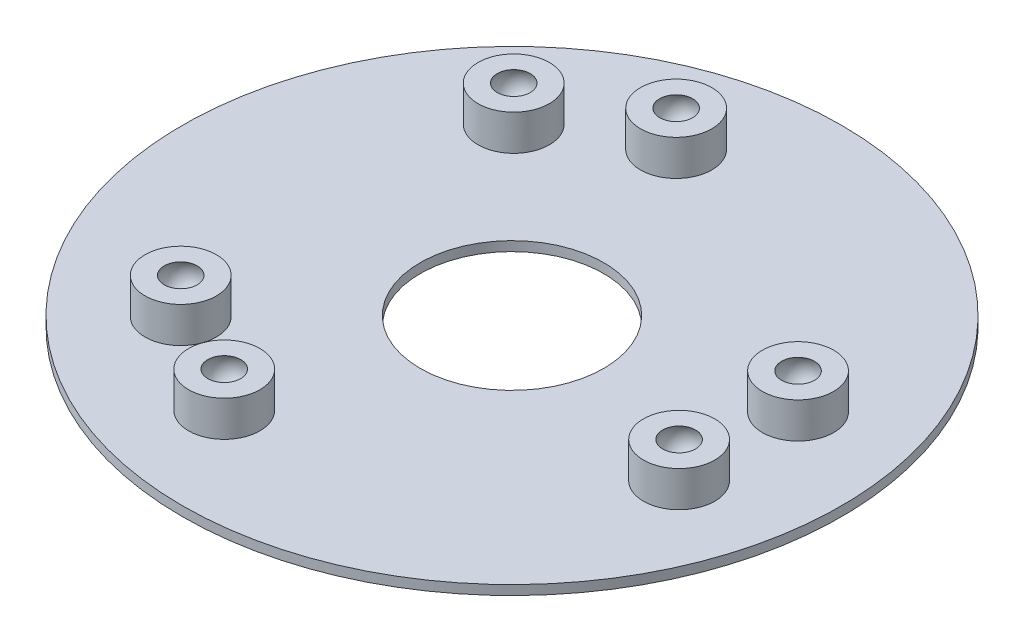
ISO-10303-21;
HEADER;
FILE_DESCRIPTION(('STEP AP214'),'2;1');
FILE_NAME('part.step','',(''),(''),'','','');
FILE_SCHEMA(('AUTOMOTIVE_DESIGN { 1 0 10303 214 1 1 1 1 }'));
ENDSEC;
DATA;
#1=APPLICATION_CONTEXT('core data for automotive mechanical design processes');
#2=APPLICATION_PROTOCOL_DEFINITION('international standard','automotive_design',2000,#1);
#3=PRODUCT_CONTEXT('',#1,'mechanical');
#4=PRODUCT('Part','Part','',(#3));
#5=PRODUCT_RELATED_PRODUCT_CATEGORY('part','',(#4));
#6=PRODUCT_DEFINITION_FORMATION('','',#4);
#7=PRODUCT_DEFINITION_CONTEXT('part definition',#1,'design');
#8=PRODUCT_DEFINITION('design','',#6,#7);
#9=PRODUCT_DEFINITION_SHAPE('','',#8);
#10=(LENGTH_UNIT() NAMED_UNIT(*) SI_UNIT(.MILLI.,.METRE.));
#11=(NAMED_UNIT(*) PLANE_ANGLE_UNIT() SI_UNIT($,.RADIAN.));
#12=(NAMED_UNIT(*) SI_UNIT($,.STERADIAN.) SOLID_ANGLE_UNIT());
#13=UNCERTAINTY_MEASURE_WITH_UNIT(LENGTH_MEASURE(1.E-05),#10,'distance_accuracy_value','');
#14=(GEOMETRIC_REPRESENTATION_CONTEXT(3) GLOBAL_UNCERTAINTY_ASSIGNED_CONTEXT((#13)) GLOBAL_UNIT_ASSIGNED_CONTEXT((#10,
#11,#12)) REPRESENTATION_CONTEXT('',''));
#15=CARTESIAN_POINT('',(0.,0.,0.));
#16=DIRECTION('',(0.,0.,1.));
#17=DIRECTION('',(1.,0.,0.));
#18=AXIS2_PLACEMENT_3D('',#15,#16,#17);
#19=CARTESIAN_POINT('',(0.,-20.,0.));
#20=DIRECTION('',(0.,1.,0.));
#21=DIRECTION('',(0.,0.,1.));
#22=AXIS2_PLACEMENT_3D('',#19,#20,#21);
#23=CYLINDRICAL_SURFACE('',#22,692.820324);
#24=CARTESIAN_POINT('',(0.,-20.,0.));
#25=DIRECTION('',(0.,1.,0.));
#26=DIRECTION('',(0.,0.,1.));
#27=AXIS2_PLACEMENT_3D('',#24,#25,#26);
#28=CIRCLE('',#27,692.820324);
#29=CARTESIAN_POINT('',(0.,-20.,692.820324));
#30=VERTEX_POINT('',#29);
#31=EDGE_CURVE('E10',#30,#30,#28,.T.);
#32=ORIENTED_EDGE('',*,*,#31,.T.);
#33=EDGE_LOOP('',(#32));
#34=FACE_BOUND('',#33,.T.);
#35=CARTESIAN_POINT('',(0.,0.,0.));
#36=DIRECTION('',(0.,1.,0.));
#37=DIRECTION('',(0.,0.,1.));
#38=AXIS2_PLACEMENT_3D('',#35,#36,#37);
#39=CIRCLE('',#38,692.820324);
#40=CARTESIAN_POINT('',(0.,0.,692.820324));
#41=VERTEX_POINT('',#40);
#42=EDGE_CURVE('E42',#41,#41,#39,.T.);
#43=ORIENTED_EDGE('',*,*,#42,.F.);
#44=EDGE_LOOP('',(#43));
#45=FACE_BOUND('',#44,.T.);
#46=ADVANCED_FACE('F39',(#34,#45),#23,.T.);
#47=CARTESIAN_POINT('',(0.,-20.,0.));
#48=DIRECTION('',(0.,1.,0.));
#49=DIRECTION('',(0.,0.,1.));
#50=AXIS2_PLACEMENT_3D('',#47,#48,#49);
#51=PLANE('',#50);
#52=CARTESIAN_POINT('',(0.,-20.,0.));
#53=DIRECTION('',(0.,1.,0.));
#54=DIRECTION('',(0.,0.,1.));
#55=AXIS2_PLACEMENT_3D('',#52,#53,#54);
#56=CIRCLE('',#55,192.820324);
#57=CARTESIAN_POINT('',(0.,-20.,192.820324));
#58=VERTEX_POINT('',#57);
#59=EDGE_CURVE('E54',#58,#58,#56,.T.);
#60=ORIENTED_EDGE('',*,*,#59,.T.);
#61=EDGE_LOOP('',(#60));
#62=FACE_BOUND('',#61,.T.);
#63=ORIENTED_EDGE('',*,*,#31,.F.);
#64=EDGE_LOOP('',(#63));
#65=FACE_BOUND('',#64,.T.);
#66=ADVANCED_FACE('F150',(#62,#65),#51,.F.);
#67=CARTESIAN_POINT('',(0.,0.,0.));
#68=DIRECTION('',(0.,1.,0.));
#69=DIRECTION('',(0.,0.,1.));
#70=AXIS2_PLACEMENT_3D('',#67,#68,#69);
#71=PLANE('',#70);
#72=CARTESIAN_POINT('',(476.314,0.,-125.));
#73=DIRECTION('',(0.,1.,0.));
#74=DIRECTION('',(0.,0.,1.));
#75=AXIS2_PLACEMENT_3D('',#72,#73,#74);
#76=CIRCLE('',#75,74.9999999999999);
#77=CARTESIAN_POINT('',(476.314,0.,-50.0000000000001));
#78=VERTEX_POINT('',#77);
#79=EDGE_CURVE('E82',#78,#78,#76,.T.);
#80=ORIENTED_EDGE('',*,*,#79,.F.);
#81=EDGE_LOOP('',(#80));
#82=FACE_BOUND('',#81,.T.);
#83=CARTESIAN_POINT('',(-346.4101615,0.,350.));
#84=DIRECTION('',(0.,1.,0.));
#85=DIRECTION('',(0.,0.,1.));
#86=AXIS2_PLACEMENT_3D('',#83,#84,#85);
#87=CIRCLE('',#86,75.);
#88=CARTESIAN_POINT('',(-346.4101615,0.,425.));
#89=VERTEX_POINT('',#88);
#90=EDGE_CURVE('E78',#89,#89,#87,.T.);
#91=ORIENTED_EDGE('',*,*,#90,.F.);
#92=EDGE_LOOP('',(#91));
#93=FACE_BOUND('',#92,.T.);
#94=CARTESIAN_POINT('',(-346.4101615,0.,-350.));
#95=DIRECTION('',(0.,1.,0.));
#96=DIRECTION('',(0.,0.,1.));
#97=AXIS2_PLACEMENT_3D('',#94,#95,#96);
#98=CIRCLE('',#97,75.);
#99=CARTESIAN_POINT('',(-346.4101615,0.,-275.));
#100=VERTEX_POINT('',#99);
#101=EDGE_CURVE('E74',#100,#100,#98,.T.);
#102=ORIENTED_EDGE('',*,*,#101,.F.);
#103=EDGE_LOOP('',(#102));
#104=FACE_BOUND('',#103,.T.);
#105=CARTESIAN_POINT('',(476.314,0.,125.));
#106=DIRECTION('',(0.,1.,0.));
#107=DIRECTION('',(0.,0.,1.));
#108=AXIS2_PLACEMENT_3D('',#105,#106,#107);
#109=CIRCLE('',#108,74.9999999999999);
#110=CARTESIAN_POINT('',(476.314,0.,200.));
#111=VERTEX_POINT('',#110);
#112=EDGE_CURVE('E70',#111,#111,#109,.T.);
#113=ORIENTED_EDGE('',*,*,#112,.F.);
#114=EDGE_LOOP('',(#113));
#115=FACE_BOUND('',#114,.T.);
#116=CARTESIAN_POINT('',(-129.90381057,0.,475.));
#117=DIRECTION('',(0.,1.,0.));
#118=DIRECTION('',(0.,0.,1.));
#119=AXIS2_PLACEMENT_3D('',#116,#117,#118);
#120=CIRCLE('',#119,75.);
#121=CARTESIAN_POINT('',(-129.90381057,0.,550.));
#122=VERTEX_POINT('',#121);
#123=EDGE_CURVE('E66',#122,#122,#120,.T.);
#124=ORIENTED_EDGE('',*,*,#123,.F.);
#125=EDGE_LOOP('',(#124));
#126=FACE_BOUND('',#125,.T.);
#127=CARTESIAN_POINT('',(-129.90381057,0.,-475.));
#128=DIRECTION('',(0.,1.,0.));
#129=DIRECTION('',(0.,0.,1.));
#130=AXIS2_PLACEMENT_3D('',#127,#128,#129);
#131=CIRCLE('',#130,75.);
#132=CARTESIAN_POINT('',(-193.009030027485,0.,-434.469378524099));
#133=VERTEX_POINT('',#132);
#134=EDGE_CURVE('E59',#133,#133,#131,.T.);
#135=ORIENTED_EDGE('',*,*,#134,.F.);
#136=EDGE_LOOP('',(#135));
#137=FACE_BOUND('',#136,.T.);
#138=CARTESIAN_POINT('',(0.,0.,0.));
#139=DIRECTION('',(0.,1.,0.));
#140=DIRECTION('',(0.,0.,1.));
#141=AXIS2_PLACEMENT_3D('',#138,#139,#140);
#142=CIRCLE('',#141,192.820324);
#143=CARTESIAN_POINT('',(0.,0.,192.820324));
#144=VERTEX_POINT('',#143);
#145=EDGE_CURVE('E56',#144,#144,#142,.T.);
#146=ORIENTED_EDGE('',*,*,#145,.F.);
#147=EDGE_LOOP('',(#146));
#148=FACE_BOUND('',#147,.T.);
#149=ORIENTED_EDGE('',*,*,#42,.T.);
#150=EDGE_LOOP('',(#149));
#151=FACE_BOUND('',#150,.T.);
#152=ADVANCED_FACE('F154',(#82,#93,#104,#115,#126,#137,#148,#151),#71,.T.);
#153=CARTESIAN_POINT('',(0.,-20.,0.));
#154=DIRECTION('',(0.,1.,0.));
#155=DIRECTION('',(0.,0.,1.));
#156=AXIS2_PLACEMENT_3D('',#153,#154,#155);
#157=CYLINDRICAL_SURFACE('',#156,192.820324);
#158=ORIENTED_EDGE('',*,*,#59,.F.);
#159=EDGE_LOOP('',(#158));
#160=FACE_BOUND('',#159,.T.);
#161=ORIENTED_EDGE('',*,*,#145,.T.);
#162=EDGE_LOOP('',(#161));
#163=FACE_BOUND('',#162,.T.);
#164=ADVANCED_FACE('F161',(#160,#163),#157,.F.);
#165=CARTESIAN_POINT('',(476.313999999993,55.0000000000006,125.000000000031));
#166=DIRECTION('',(0.,1.,0.));
#167=DIRECTION('',(-0.881552564647167,0.,-0.472085877530776));
#168=AXIS2_PLACEMENT_3D('',#165,#166,#167);
#169=SPHERICAL_SURFACE('',#168,40.);
#170=CARTESIAN_POINT('',(476.313999999993,75.0000000000005,125.000000000031));
#171=DIRECTION('',(0.,1.,0.));
#172=DIRECTION('',(0.881552564647167,0.,0.472085877530776));
#173=AXIS2_PLACEMENT_3D('',#170,#171,#172);
#174=CIRCLE('',#173,34.6410161513776);
#175=CARTESIAN_POINT('',(506.851876630224,75.0000000000005,141.353534508412));
#176=VERTEX_POINT('',#175);
#177=EDGE_CURVE('E86',#176,#176,#174,.T.);
#178=ORIENTED_EDGE('',*,*,#177,.T.);
#179=EDGE_LOOP('',(#178));
#180=FACE_BOUND('',#179,.T.);
#181=ADVANCED_FACE('F166',(#180),#169,.F.);
#182=CARTESIAN_POINT('',(410.197557651455,75.0000000000005,89.593559185223));
#183=DIRECTION('',(0.,-1.,0.));
#184=DIRECTION('',(-0.881552564647167,0.,-0.472085877530776));
#185=AXIS2_PLACEMENT_3D('',#182,#183,#184);
#186=PLANE('',#185);
#187=ORIENTED_EDGE('',*,*,#177,.F.);
#188=EDGE_LOOP('',(#187));
#189=FACE_BOUND('',#188,.T.);
#190=CARTESIAN_POINT('',(476.313999999993,75.0000000000005,125.000000000031));
#191=DIRECTION('',(0.,1.,0.));
#192=DIRECTION('',(0.881552564647167,0.,0.472085877530776));
#193=AXIS2_PLACEMENT_3D('',#190,#191,#192);
#194=CIRCLE('',#193,75.);
#195=CARTESIAN_POINT('',(542.43044234853,75.0000000000006,160.406440814839));
#196=VERTEX_POINT('',#195);
#197=EDGE_CURVE('E90',#196,#196,#194,.T.);
#198=ORIENTED_EDGE('',*,*,#197,.T.);
#199=EDGE_LOOP('',(#198));
#200=FACE_BOUND('',#199,.T.);
#201=ADVANCED_FACE('F174',(#189,#200),#186,.F.);
#202=CARTESIAN_POINT('',(476.313999999993,76.4620325892802,125.000000000031));
#203=DIRECTION('',(0.,1.,0.));
#204=DIRECTION('',(0.881552564647167,0.,0.472085877530776));
#205=AXIS2_PLACEMENT_3D('',#202,#203,#204);
#206=CYLINDRICAL_SURFACE('',#205,75.);
#207=ORIENTED_EDGE('',*,*,#112,.T.);
#208=EDGE_LOOP('',(#207));
#209=FACE_BOUND('',#208,.T.);
#210=ORIENTED_EDGE('',*,*,#197,.F.);
#211=EDGE_LOOP('',(#210));
#212=FACE_BOUND('',#211,.T.);
#213=ADVANCED_FACE('F178',(#209,#212),#206,.T.);
#214=CARTESIAN_POINT('',(-129.903810570017,55.0000000000006,475.000000000015));
#215=DIRECTION('',(0.,1.,0.));
#216=DIRECTION('',(0.855507178228857,0.,-0.517790950093664));
#217=AXIS2_PLACEMENT_3D('',#214,#215,#216);
#218=SPHERICAL_SURFACE('',#217,40.);
#219=CARTESIAN_POINT('',(-129.903810570017,75.0000000000005,475.000000000015));
#220=DIRECTION('',(0.,1.,0.));
#221=DIRECTION('',(-0.855507178228857,0.,0.517790950093664));
#222=AXIS2_PLACEMENT_3D('',#219,#220,#221);
#223=CIRCLE('',#222,34.6410161513776);
#224=CARTESIAN_POINT('',(-159.539448548662,75.0000000000005,492.936804665246));
#225=VERTEX_POINT('',#224);
#226=EDGE_CURVE('E98',#225,#225,#223,.T.);
#227=ORIENTED_EDGE('',*,*,#226,.T.);
#228=EDGE_LOOP('',(#227));
#229=FACE_BOUND('',#228,.T.);
#230=ADVANCED_FACE('F182',(#229),#218,.F.);
#231=CARTESIAN_POINT('',(-65.7407722028523,75.0000000000005,436.16567874299));
#232=DIRECTION('',(0.,-1.,0.));
#233=DIRECTION('',(0.855507178228857,0.,-0.517790950093664));
#234=AXIS2_PLACEMENT_3D('',#231,#232,#233);
#235=PLANE('',#234);
#236=ORIENTED_EDGE('',*,*,#226,.F.);
#237=EDGE_LOOP('',(#236));
#238=FACE_BOUND('',#237,.T.);
#239=CARTESIAN_POINT('',(-129.903810570017,75.0000000000005,475.000000000015));
#240=DIRECTION('',(0.,1.,0.));
#241=DIRECTION('',(-0.855507178228857,0.,0.517790950093664));
#242=AXIS2_PLACEMENT_3D('',#239,#240,#241);
#243=CIRCLE('',#242,75.);
#244=CARTESIAN_POINT('',(-194.066848937181,75.0000000000005,513.83432125704));
#245=VERTEX_POINT('',#244);
#246=EDGE_CURVE('E94',#245,#245,#243,.T.);
#247=ORIENTED_EDGE('',*,*,#246,.T.);
#248=EDGE_LOOP('',(#247));
#249=FACE_BOUND('',#248,.T.);
#250=ADVANCED_FACE('F188',(#238,#249),#235,.F.);
#251=CARTESIAN_POINT('',(-129.903810570017,76.4620325892802,475.000000000015));
#252=DIRECTION('',(0.,1.,0.));
#253=DIRECTION('',(-0.855507178228857,0.,0.517790950093664));
#254=AXIS2_PLACEMENT_3D('',#251,#252,#253);
#255=CYLINDRICAL_SURFACE('',#254,75.);
#256=ORIENTED_EDGE('',*,*,#123,.T.);
#257=EDGE_LOOP('',(#256));
#258=FACE_BOUND('',#257,.T.);
#259=ORIENTED_EDGE('',*,*,#246,.F.);
#260=EDGE_LOOP('',(#259));
#261=FACE_BOUND('',#260,.T.);
#262=ADVANCED_FACE('F184',(#258,#261),#255,.T.);
#263=CARTESIAN_POINT('',(-346.410161499995,55.0000000000006,-349.999999999991));
#264=DIRECTION('',(0.,1.,0.));
#265=DIRECTION('',(0.855507178228857,0.,-0.517790950093664));
#266=AXIS2_PLACEMENT_3D('',#263,#264,#265);
#267=SPHERICAL_SURFACE('',#266,40.);
#268=CARTESIAN_POINT('',(-346.410161499995,75.0000000000005,-349.999999999991));
#269=DIRECTION('',(0.,1.,0.));
#270=DIRECTION('',(-0.855507178228857,0.,0.517790950093664));
#271=AXIS2_PLACEMENT_3D('',#268,#269,#270);
#272=CIRCLE('',#271,34.6410161513776);
#273=CARTESIAN_POINT('',(-376.04579947864,75.0000000000005,-332.063195334759));
#274=VERTEX_POINT('',#273);
#275=EDGE_CURVE('E106',#274,#274,#272,.T.);
#276=ORIENTED_EDGE('',*,*,#275,.T.);
#277=EDGE_LOOP('',(#276));
#278=FACE_BOUND('',#277,.T.);
#279=ADVANCED_FACE('F187',(#278),#267,.F.);
#280=CARTESIAN_POINT('',(-282.24712313283,75.0000000000005,-388.834321257016));
#281=DIRECTION('',(0.,-1.,0.));
#282=DIRECTION('',(0.855507178228857,0.,-0.517790950093664));
#283=AXIS2_PLACEMENT_3D('',#280,#281,#282);
#284=PLANE('',#283);
#285=ORIENTED_EDGE('',*,*,#275,.F.);
#286=EDGE_LOOP('',(#285));
#287=FACE_BOUND('',#286,.T.);
#288=CARTESIAN_POINT('',(-346.410161499995,75.0000000000005,-349.999999999991));
#289=DIRECTION('',(0.,1.,0.));
#290=DIRECTION('',(-0.855507178228857,0.,0.517790950093664));
#291=AXIS2_PLACEMENT_3D('',#288,#289,#290);
#292=CIRCLE('',#291,75.);
#293=CARTESIAN_POINT('',(-410.573199867159,75.0000000000005,-311.165678742966));
#294=VERTEX_POINT('',#293);
#295=EDGE_CURVE('E102',#294,#294,#292,.T.);
#296=ORIENTED_EDGE('',*,*,#295,.T.);
#297=EDGE_LOOP('',(#296));
#298=FACE_BOUND('',#297,.T.);
#299=ADVANCED_FACE('F200',(#287,#298),#284,.F.);
#300=CARTESIAN_POINT('',(-346.410161499995,76.4620325892802,-349.999999999991));
#301=DIRECTION('',(0.,1.,0.));
#302=DIRECTION('',(-0.855507178228857,0.,0.517790950093664));
#303=AXIS2_PLACEMENT_3D('',#300,#301,#302);
#304=CYLINDRICAL_SURFACE('',#303,75.);
#305=ORIENTED_EDGE('',*,*,#101,.T.);
#306=EDGE_LOOP('',(#305));
#307=FACE_BOUND('',#306,.T.);
#308=ORIENTED_EDGE('',*,*,#295,.F.);
#309=EDGE_LOOP('',(#308));
#310=FACE_BOUND('',#309,.T.);
#311=ADVANCED_FACE('F196',(#307,#310),#304,.T.);
#312=CARTESIAN_POINT('',(-129.903810569991,55.0000000000006,-474.999999999986));
#313=DIRECTION('',(0.,1.,0.));
#314=DIRECTION('',(0.841402926099914,0.,-0.540408286345151));
#315=AXIS2_PLACEMENT_3D('',#312,#313,#314);
#316=SPHERICAL_SURFACE('',#315,40.);
#317=CARTESIAN_POINT('',(-129.903810569991,75.0000000000005,-474.999999999986));
#318=DIRECTION('',(0.,1.,0.));
#319=DIRECTION('',(-0.841402926099914,0.,0.540408286345151));
#320=AXIS2_PLACEMENT_3D('',#317,#318,#319);
#321=CIRCLE('',#320,34.6410161513776);
#322=CARTESIAN_POINT('',(-159.050862922835,75.0000000000005,-456.279707824365));
#323=VERTEX_POINT('',#322);
#324=EDGE_CURVE('E113',#323,#323,#321,.T.);
#325=ORIENTED_EDGE('',*,*,#324,.T.);
#326=EDGE_LOOP('',(#325));
#327=FACE_BOUND('',#326,.T.);
#328=ADVANCED_FACE('F199',(#327),#316,.F.);
#329=CARTESIAN_POINT('',(-66.7985911124976,75.0000000000005,-515.530621475872));
#330=DIRECTION('',(0.,-1.,0.));
#331=DIRECTION('',(0.841402926099914,0.,-0.540408286345151));
#332=AXIS2_PLACEMENT_3D('',#329,#330,#331);
#333=PLANE('',#332);
#334=ORIENTED_EDGE('',*,*,#324,.F.);
#335=EDGE_LOOP('',(#334));
#336=FACE_BOUND('',#335,.T.);
#337=CARTESIAN_POINT('',(-129.903810569991,75.0000000000005,-474.999999999986));
#338=DIRECTION('',(0.,1.,0.));
#339=DIRECTION('',(-0.841402926099914,0.,0.540408286345151));
#340=AXIS2_PLACEMENT_3D('',#337,#338,#339);
#341=CIRCLE('',#340,75.);
#342=CARTESIAN_POINT('',(-193.009030027485,75.0000000000005,-434.469378524099));
#343=VERTEX_POINT('',#342);
#344=EDGE_CURVE('E109',#343,#343,#341,.T.);
#345=ORIENTED_EDGE('',*,*,#344,.T.);
#346=EDGE_LOOP('',(#345));
#347=FACE_BOUND('',#346,.T.);
#348=ADVANCED_FACE('F212',(#336,#347),#333,.F.);
#349=CARTESIAN_POINT('',(-129.903810569991,76.4620325892802,-474.999999999986));
#350=DIRECTION('',(0.,1.,0.));
#351=DIRECTION('',(-0.841402926099914,0.,0.540408286345151));
#352=AXIS2_PLACEMENT_3D('',#349,#350,#351);
#353=CYLINDRICAL_SURFACE('',#352,75.);
#354=CARTESIAN_POINT('',(-193.009030027485,0.,-434.469378524099));
#355=CARTESIAN_POINT('',(-193.009030027485,0.781249999999993,-434.469378524099));
#356=CARTESIAN_POINT('',(-193.009030027485,1.5625,-434.469378524099));
#357=CARTESIAN_POINT('',(-193.009030027485,3.12500000000001,-434.469378524099));
#358=CARTESIAN_POINT('',(-193.009030027485,3.90625000000002,-434.469378524099));
#359=CARTESIAN_POINT('',(-193.009030027485,5.46875000000003,-434.469378524099));
#360=CARTESIAN_POINT('',(-193.009030027485,6.25000000000003,-434.469378524099));
#361=CARTESIAN_POINT('',(-193.009030027485,7.81250000000004,-434.469378524099));
#362=CARTESIAN_POINT('',(-193.009030027485,8.59375000000004,-434.469378524099));
#363=CARTESIAN_POINT('',(-193.009030027485,10.1562500000001,-434.469378524099));
#364=CARTESIAN_POINT('',(-193.009030027485,10.9375000000001,-434.469378524099));
#365=CARTESIAN_POINT('',(-193.009030027485,12.5000000000001,-434.469378524099));
#366=CARTESIAN_POINT('',(-193.009030027485,13.2812500000001,-434.469378524099));
#367=CARTESIAN_POINT('',(-193.009030027485,14.8437500000001,-434.469378524099));
#368=CARTESIAN_POINT('',(-193.009030027485,15.6250000000001,-434.469378524099));
#369=CARTESIAN_POINT('',(-193.009030027485,17.1875000000001,-434.469378524099));
#370=CARTESIAN_POINT('',(-193.009030027485,17.9687500000001,-434.469378524099));
#371=CARTESIAN_POINT('',(-193.009030027485,19.5312500000001,-434.469378524099));
#372=CARTESIAN_POINT('',(-193.009030027485,20.3125000000001,-434.469378524099));
#373=CARTESIAN_POINT('',(-193.009030027485,21.8750000000001,-434.469378524099));
#374=CARTESIAN_POINT('',(-193.009030027485,22.6562500000001,-434.469378524099));
#375=CARTESIAN_POINT('',(-193.009030027485,24.2187500000002,-434.469378524099));
#376=CARTESIAN_POINT('',(-193.009030027485,25.0000000000002,-434.469378524099));
#377=CARTESIAN_POINT('',(-193.009030027485,26.5625000000002,-434.469378524099));
#378=CARTESIAN_POINT('',(-193.009030027485,27.3437500000002,-434.469378524099));
#379=CARTESIAN_POINT('',(-193.009030027485,28.9062500000002,-434.469378524099));
#380=CARTESIAN_POINT('',(-193.009030027485,29.6875000000002,-434.469378524099));
#381=CARTESIAN_POINT('',(-193.009030027485,31.2500000000002,-434.469378524099));
#382=CARTESIAN_POINT('',(-193.009030027485,32.0312500000002,-434.469378524099));
#383=CARTESIAN_POINT('',(-193.009030027485,33.5937500000002,-434.469378524099));
#384=CARTESIAN_POINT('',(-193.009030027485,34.3750000000002,-434.469378524099));
#385=CARTESIAN_POINT('',(-193.009030027485,35.9375000000002,-434.469378524099));
#386=CARTESIAN_POINT('',(-193.009030027485,36.7187500000002,-434.469378524099));
#387=CARTESIAN_POINT('',(-193.009030027485,38.2812500000003,-434.469378524099));
#388=CARTESIAN_POINT('',(-193.009030027485,39.0625000000003,-434.469378524099));
#389=CARTESIAN_POINT('',(-193.009030027485,40.6250000000003,-434.469378524099));
#390=CARTESIAN_POINT('',(-193.009030027485,41.4062500000003,-434.469378524099));
#391=CARTESIAN_POINT('',(-193.009030027485,42.9687500000003,-434.469378524099));
#392=CARTESIAN_POINT('',(-193.009030027485,43.7500000000003,-434.469378524099));
#393=CARTESIAN_POINT('',(-193.009030027485,45.3125000000003,-434.469378524099));
#394=CARTESIAN_POINT('',(-193.009030027485,46.0937500000003,-434.469378524099));
#395=CARTESIAN_POINT('',(-193.009030027485,47.6562500000003,-434.469378524099));
#396=CARTESIAN_POINT('',(-193.009030027485,48.4375000000003,-434.469378524099));
#397=CARTESIAN_POINT('',(-193.009030027485,50.0000000000003,-434.469378524099));
#398=CARTESIAN_POINT('',(-193.009030027485,50.7812500000003,-434.469378524099));
#399=CARTESIAN_POINT('',(-193.009030027485,52.3437500000003,-434.469378524099));
#400=CARTESIAN_POINT('',(-193.009030027485,53.1250000000004,-434.469378524099));
#401=CARTESIAN_POINT('',(-193.009030027485,54.6875000000004,-434.469378524099));
#402=CARTESIAN_POINT('',(-193.009030027485,55.4687500000004,-434.469378524099));
#403=CARTESIAN_POINT('',(-193.009030027485,57.0312500000004,-434.469378524099));
#404=CARTESIAN_POINT('',(-193.009030027485,57.8125000000004,-434.469378524099));
#405=CARTESIAN_POINT('',(-193.009030027485,59.3750000000004,-434.469378524099));
#406=CARTESIAN_POINT('',(-193.009030027485,60.1562500000004,-434.469378524099));
#407=CARTESIAN_POINT('',(-193.009030027485,61.7187500000004,-434.469378524099));
#408=CARTESIAN_POINT('',(-193.009030027485,62.5000000000004,-434.469378524099));
#409=CARTESIAN_POINT('',(-193.009030027485,64.0625000000004,-434.469378524099));
#410=CARTESIAN_POINT('',(-193.009030027485,64.8437500000004,-434.469378524099));
#411=CARTESIAN_POINT('',(-193.009030027485,66.4062500000005,-434.469378524099));
#412=CARTESIAN_POINT('',(-193.009030027485,67.1875000000005,-434.469378524099));
#413=CARTESIAN_POINT('',(-193.009030027485,68.7500000000005,-434.469378524099));
#414=CARTESIAN_POINT('',(-193.009030027485,69.5312500000005,-434.469378524099));
#415=CARTESIAN_POINT('',(-193.009030027485,71.0937500000005,-434.469378524099));
#416=CARTESIAN_POINT('',(-193.009030027485,71.8750000000005,-434.469378524099));
#417=CARTESIAN_POINT('',(-193.009030027485,73.4375000000005,-434.469378524099));
#418=CARTESIAN_POINT('',(-193.009030027485,74.2187500000005,-434.469378524099));
#419=CARTESIAN_POINT('',(-193.009030027485,75.0000000000005,-434.469378524099));
#420=B_SPLINE_CURVE_WITH_KNOTS('',3,(#354,#355,#356,#357,#358,#359,#360,#361,#362,#363,#364,
#365,#366,#367,#368,#369,#370,#371,#372,#373,#374,#375,#376,#377,#378,#379,#380,#381,#382,#383,
#384,#385,#386,#387,#388,#389,#390,#391,#392,#393,#394,#395,#396,#397,#398,#399,#400,#401,#402,
#403,#404,#405,#406,#407,#408,#409,#410,#411,#412,#413,#414,#415,#416,#417,#418,#419),
.UNSPECIFIED.,.F.,.F.,(4,2,2,2,2,2,2,2,2,2,2,2,2,2,2,2,2,2,2,2,2,2,2,2,2,2,2,2,2,2,2,2,4),(0.,
2.34375000000002,4.68750000000004,7.03125000000004,9.37500000000006,11.7187500000001,
14.0625000000001,16.4062500000001,18.7500000000001,21.0937500000001,23.4375000000002,
25.7812500000002,28.1250000000002,30.4687500000002,32.8125000000002,35.1562500000002,
37.5000000000003,39.8437500000003,42.1875000000003,44.5312500000003,46.8750000000003,
49.2187500000003,51.5625000000004,53.9062500000004,56.2500000000004,58.5937500000004,
60.9375000000004,63.2812500000004,65.6250000000005,67.9687500000005,70.3125000000005,
72.6562500000005,75.0000000000005),.UNSPECIFIED.);
#421=EDGE_CURVE('BSEAM208',#133,#343,#420,.T.);
#422=ORIENTED_EDGE('',*,*,#134,.T.);
#423=ORIENTED_EDGE('',*,*,#344,.F.);
#424=ORIENTED_EDGE('',*,*,#421,.T.);
#425=ORIENTED_EDGE('',*,*,#421,.F.);
#426=EDGE_LOOP('',(#422,#424,#423,#425));
#427=FACE_BOUND('',#426,.T.);
#428=ADVANCED_FACE('F208',(#427),#353,.T.);
#429=CARTESIAN_POINT('',(-346.410161500014,55.0000000000006,350.000000000009));
#430=DIRECTION('',(0.,1.,0.));
#431=DIRECTION('',(0.855507178228857,0.,-0.517790950093664));
#432=AXIS2_PLACEMENT_3D('',#429,#430,#431);
#433=SPHERICAL_SURFACE('',#432,40.);
#434=CARTESIAN_POINT('',(-346.410161500014,75.0000000000005,350.000000000009));
#435=DIRECTION('',(0.,1.,0.));
#436=DIRECTION('',(-0.855507178228857,0.,0.517790950093664));
#437=AXIS2_PLACEMENT_3D('',#434,#435,#436);
#438=CIRCLE('',#437,34.6410161513776);
#439=CARTESIAN_POINT('',(-376.045799478659,75.0000000000005,367.936804665241));
#440=VERTEX_POINT('',#439);
#441=EDGE_CURVE('E121',#440,#440,#438,.T.);
#442=ORIENTED_EDGE('',*,*,#441,.T.);
#443=EDGE_LOOP('',(#442));
#444=FACE_BOUND('',#443,.T.);
#445=ADVANCED_FACE('F211',(#444),#433,.F.);
#446=CARTESIAN_POINT('',(-282.247123132849,75.0000000000005,311.165678742984));
#447=DIRECTION('',(0.,-1.,0.));
#448=DIRECTION('',(0.855507178228857,0.,-0.517790950093664));
#449=AXIS2_PLACEMENT_3D('',#446,#447,#448);
#450=PLANE('',#449);
#451=ORIENTED_EDGE('',*,*,#441,.F.);
#452=EDGE_LOOP('',(#451));
#453=FACE_BOUND('',#452,.T.);
#454=CARTESIAN_POINT('',(-346.410161500014,75.0000000000005,350.000000000009));
#455=DIRECTION('',(0.,1.,0.));
#456=DIRECTION('',(-0.855507178228857,0.,0.517790950093664));
#457=AXIS2_PLACEMENT_3D('',#454,#455,#456);
#458=CIRCLE('',#457,75.);
#459=CARTESIAN_POINT('',(-410.573199867178,75.0000000000005,388.834321257034));
#460=VERTEX_POINT('',#459);
#461=EDGE_CURVE('E117',#460,#460,#458,.T.);
#462=ORIENTED_EDGE('',*,*,#461,.T.);
#463=EDGE_LOOP('',(#462));
#464=FACE_BOUND('',#463,.T.);
#465=ADVANCED_FACE('F223',(#453,#464),#450,.F.);
#466=CARTESIAN_POINT('',(-346.410161500014,76.4620325892802,350.000000000009));
#467=DIRECTION('',(0.,1.,0.));
#468=DIRECTION('',(-0.855507178228857,0.,0.517790950093664));
#469=AXIS2_PLACEMENT_3D('',#466,#467,#468);
#470=CYLINDRICAL_SURFACE('',#469,75.);
#471=ORIENTED_EDGE('',*,*,#90,.T.);
#472=EDGE_LOOP('',(#471));
#473=FACE_BOUND('',#472,.T.);
#474=ORIENTED_EDGE('',*,*,#461,.F.);
#475=EDGE_LOOP('',(#474));
#476=FACE_BOUND('',#475,.T.);
#477=ADVANCED_FACE('F220',(#473,#476),#470,.T.);
#478=CARTESIAN_POINT('',(476.313999999999,55.0000000000006,-124.999999999969));
#479=DIRECTION('',(0.,1.,0.));
#480=DIRECTION('',(0.350274337787098,0.,0.936647152500775));
#481=AXIS2_PLACEMENT_3D('',#478,#479,#480);
#482=SPHERICAL_SURFACE('',#481,40.);
#483=CARTESIAN_POINT('',(476.313999999999,75.0000000000005,-124.999999999969));
#484=DIRECTION('',(0.,1.,0.));
#485=DIRECTION('',(-0.350274337787098,0.,-0.936647152500775));
#486=AXIS2_PLACEMENT_3D('',#483,#484,#485);
#487=CIRCLE('',#486,34.6410161513776);
#488=CARTESIAN_POINT('',(464.180141007303,75.0000000000005,-157.44640913789));
#489=VERTEX_POINT('',#488);
#490=EDGE_CURVE('E129',#489,#489,#487,.T.);
#491=ORIENTED_EDGE('',*,*,#490,.T.);
#492=EDGE_LOOP('',(#491));
#493=FACE_BOUND('',#492,.T.);
#494=ADVANCED_FACE('F134',(#493),#482,.F.);
#495=CARTESIAN_POINT('',(502.584575334032,75.0000000000005,-54.7514635624108));
#496=DIRECTION('',(0.,-1.,0.));
#497=DIRECTION('',(0.350274337787098,0.,0.936647152500775));
#498=AXIS2_PLACEMENT_3D('',#495,#496,#497);
#499=PLANE('',#498);
#500=ORIENTED_EDGE('',*,*,#490,.F.);
#501=EDGE_LOOP('',(#500));
#502=FACE_BOUND('',#501,.T.);
#503=CARTESIAN_POINT('',(476.313999999999,75.0000000000005,-124.999999999969));
#504=DIRECTION('',(0.,1.,0.));
#505=DIRECTION('',(-0.350274337787098,0.,-0.936647152500775));
#506=AXIS2_PLACEMENT_3D('',#503,#504,#505);
#507=CIRCLE('',#506,75.);
#508=CARTESIAN_POINT('',(450.043424665967,75.0000000000005,-195.248536437527));
#509=VERTEX_POINT('',#508);
#510=EDGE_CURVE('E125',#509,#509,#507,.T.);
#511=ORIENTED_EDGE('',*,*,#510,.T.);
#512=EDGE_LOOP('',(#511));
#513=FACE_BOUND('',#512,.T.);
#514=ADVANCED_FACE('F136',(#502,#513),#499,.F.);
#515=CARTESIAN_POINT('',(476.313999999999,76.4620325892802,-124.999999999969));
#516=DIRECTION('',(0.,1.,0.));
#517=DIRECTION('',(-0.350274337787098,0.,-0.936647152500775));
#518=AXIS2_PLACEMENT_3D('',#515,#516,#517);
#519=CYLINDRICAL_SURFACE('',#518,75.);
#520=ORIENTED_EDGE('',*,*,#79,.T.);
#521=EDGE_LOOP('',(#520));
#522=FACE_BOUND('',#521,.T.);
#523=ORIENTED_EDGE('',*,*,#510,.F.);
#524=EDGE_LOOP('',(#523));
#525=FACE_BOUND('',#524,.T.);
#526=ADVANCED_FACE('F139',(#522,#525),#519,.T.);
#527=CLOSED_SHELL('',(#46,#66,#152,#164,#181,#201,#213,#230,#250,#262,#279,#299,#311,#328,#348,
#428,#445,#465,#477,#494,#514,#526));
#528=MANIFOLD_SOLID_BREP('B2',#527);
#529=ADVANCED_BREP_SHAPE_REPRESENTATION('',(#18,#528),#14);
#530=SHAPE_DEFINITION_REPRESENTATION(#9,#529);
ENDSEC;
END-ISO-10303-21;
